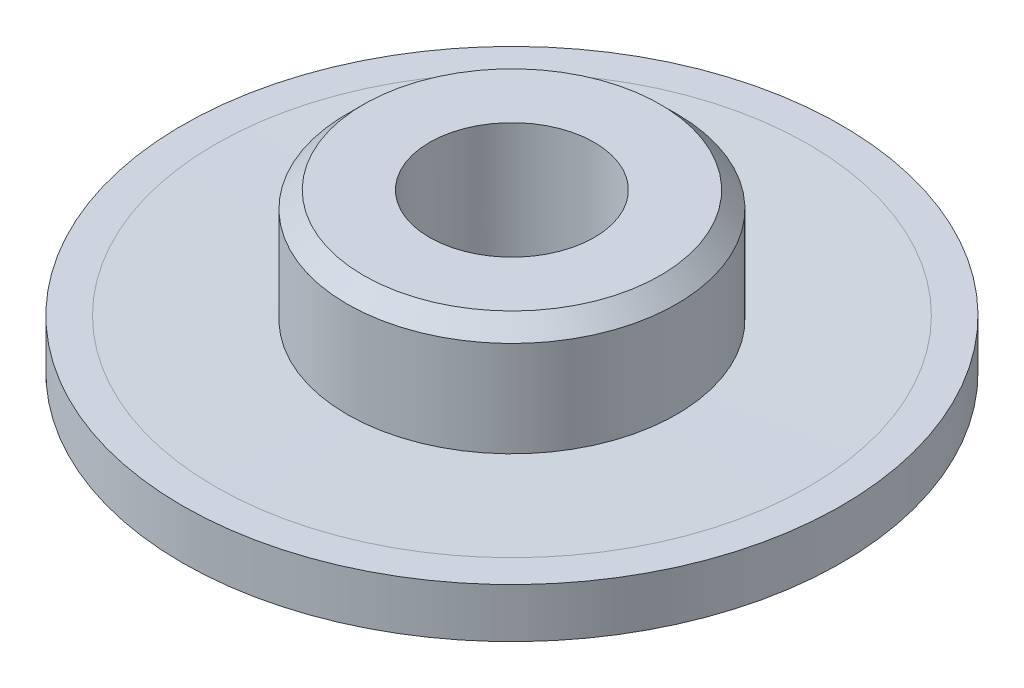
ISO-10303-21;
HEADER;
FILE_DESCRIPTION(('STEP AP214'),'2;1');
FILE_NAME('part.step','',(''),(''),'','','');
FILE_SCHEMA(('AUTOMOTIVE_DESIGN { 1 0 10303 214 1 1 1 1 }'));
ENDSEC;
DATA;
#1=APPLICATION_CONTEXT('core data for automotive mechanical design processes');
#2=APPLICATION_PROTOCOL_DEFINITION('international standard','automotive_design',2000,#1);
#3=PRODUCT_CONTEXT('',#1,'mechanical');
#4=PRODUCT('Part','Part','',(#3));
#5=PRODUCT_RELATED_PRODUCT_CATEGORY('part','',(#4));
#6=PRODUCT_DEFINITION_FORMATION('','',#4);
#7=PRODUCT_DEFINITION_CONTEXT('part definition',#1,'design');
#8=PRODUCT_DEFINITION('design','',#6,#7);
#9=PRODUCT_DEFINITION_SHAPE('','',#8);
#10=(LENGTH_UNIT() NAMED_UNIT(*) SI_UNIT(.MILLI.,.METRE.));
#11=(NAMED_UNIT(*) PLANE_ANGLE_UNIT() SI_UNIT($,.RADIAN.));
#12=(NAMED_UNIT(*) SI_UNIT($,.STERADIAN.) SOLID_ANGLE_UNIT());
#13=UNCERTAINTY_MEASURE_WITH_UNIT(LENGTH_MEASURE(1.E-05),#10,'distance_accuracy_value','');
#14=(GEOMETRIC_REPRESENTATION_CONTEXT(3) GLOBAL_UNCERTAINTY_ASSIGNED_CONTEXT((#13)) GLOBAL_UNIT_ASSIGNED_CONTEXT((#10,
#11,#12)) REPRESENTATION_CONTEXT('',''));
#15=CARTESIAN_POINT('',(0.,0.,0.));
#16=DIRECTION('',(0.,0.,1.));
#17=DIRECTION('',(1.,0.,0.));
#18=AXIS2_PLACEMENT_3D('',#15,#16,#17);
#19=CARTESIAN_POINT('',(0.,0.,0.));
#20=DIRECTION('',(0.,-1.,0.));
#21=DIRECTION('',(0.,0.,-1.));
#22=AXIS2_PLACEMENT_3D('',#19,#20,#21);
#23=CYLINDRICAL_SURFACE('',#22,2.5);
#24=CARTESIAN_POINT('',(0.,0.,0.));
#25=DIRECTION('',(0.,-1.,0.));
#26=DIRECTION('',(0.,0.,-1.));
#27=AXIS2_PLACEMENT_3D('',#24,#25,#26);
#28=CIRCLE('',#27,2.5);
#29=CARTESIAN_POINT('',(0.,0.,-2.5));
#30=VERTEX_POINT('',#29);
#31=EDGE_CURVE('E22',#30,#30,#28,.T.);
#32=ORIENTED_EDGE('',*,*,#31,.T.);
#33=EDGE_LOOP('',(#32));
#34=FACE_BOUND('',#33,.T.);
#35=CARTESIAN_POINT('',(0.,4.80000000000003,0.));
#36=DIRECTION('',(0.,1.,0.));
#37=DIRECTION('',(0.,0.,1.));
#38=AXIS2_PLACEMENT_3D('',#35,#36,#37);
#39=CIRCLE('',#38,2.5);
#40=CARTESIAN_POINT('',(0.,4.80000000000003,2.5));
#41=VERTEX_POINT('',#40);
#42=EDGE_CURVE('E10',#41,#41,#39,.T.);
#43=ORIENTED_EDGE('',*,*,#42,.T.);
#44=EDGE_LOOP('',(#43));
#45=FACE_BOUND('',#44,.T.);
#46=ADVANCED_FACE('F14',(#34,#45),#23,.F.);
#47=CARTESIAN_POINT('',(0.,-3.57627205087724,0.));
#48=DIRECTION('',(0.,1.,0.));
#49=DIRECTION('',(0.,0.,1.));
#50=AXIS2_PLACEMENT_3D('',#47,#48,#49);
#51=CYLINDRICAL_SURFACE('',#50,5.00000000024337);
#52=CARTESIAN_POINT('',(0.,4.3000000004757,0.));
#53=DIRECTION('',(0.,1.,0.));
#54=DIRECTION('',(0.,0.,1.));
#55=AXIS2_PLACEMENT_3D('',#52,#53,#54);
#56=CIRCLE('',#55,5.00000000024337);
#57=CARTESIAN_POINT('',(0.,4.3000000004757,5.00000000024334));
#58=VERTEX_POINT('',#57);
#59=EDGE_CURVE('E33',#58,#58,#56,.T.);
#60=ORIENTED_EDGE('',*,*,#59,.F.);
#61=EDGE_LOOP('',(#60));
#62=FACE_BOUND('',#61,.T.);
#63=CARTESIAN_POINT('',(0.,1.39999999343871,0.));
#64=DIRECTION('',(0.,1.,0.));
#65=DIRECTION('',(0.,0.,1.));
#66=AXIS2_PLACEMENT_3D('',#63,#64,#65);
#67=CIRCLE('',#66,5.00000000024337);
#68=CARTESIAN_POINT('',(0.,1.39999999343871,5.00000000024334));
#69=VERTEX_POINT('',#68);
#70=EDGE_CURVE('E27',#69,#69,#67,.T.);
#71=ORIENTED_EDGE('',*,*,#70,.T.);
#72=EDGE_LOOP('',(#71));
#73=FACE_BOUND('',#72,.T.);
#74=ADVANCED_FACE('F66',(#62,#73),#51,.T.);
#75=CARTESIAN_POINT('',(0.,1.39999999343871,0.));
#76=DIRECTION('',(0.,1.,0.));
#77=DIRECTION('',(0.,0.,1.));
#78=AXIS2_PLACEMENT_3D('',#75,#76,#77);
#79=CONICAL_SURFACE('',#78,5.00000000024337,1.54580153140963);
#80=CARTESIAN_POINT('',(0.,1.50000000050243,0.));
#81=DIRECTION('',(0.,1.,0.));
#82=DIRECTION('',(0.,0.,1.));
#83=AXIS2_PLACEMENT_3D('',#80,#81,#82);
#84=CIRCLE('',#83,9.);
#85=CARTESIAN_POINT('',(0.,1.50000000050243,8.99999999999998));
#86=VERTEX_POINT('',#85);
#87=EDGE_CURVE('E32',#86,#86,#84,.T.);
#88=ORIENTED_EDGE('',*,*,#87,.T.);
#89=EDGE_LOOP('',(#88));
#90=FACE_BOUND('',#89,.T.);
#91=ORIENTED_EDGE('',*,*,#70,.F.);
#92=EDGE_LOOP('',(#91));
#93=FACE_BOUND('',#92,.T.);
#94=ADVANCED_FACE('F62',(#90,#93),#79,.F.);
#95=CARTESIAN_POINT('',(0.,-3.57627205087724,0.));
#96=DIRECTION('',(0.,1.,0.));
#97=DIRECTION('',(0.,0.,1.));
#98=AXIS2_PLACEMENT_3D('',#95,#96,#97);
#99=CYLINDRICAL_SURFACE('',#98,10.0000000002426);
#100=CARTESIAN_POINT('',(0.,1.50000000050243,0.));
#101=DIRECTION('',(0.,1.,0.));
#102=DIRECTION('',(0.,0.,1.));
#103=AXIS2_PLACEMENT_3D('',#100,#101,#102);
#104=CIRCLE('',#103,10.0000000002426);
#105=CARTESIAN_POINT('',(0.,1.50000000050243,10.0000000002426));
#106=VERTEX_POINT('',#105);
#107=EDGE_CURVE('E40',#106,#106,#104,.T.);
#108=ORIENTED_EDGE('',*,*,#107,.F.);
#109=EDGE_LOOP('',(#108));
#110=FACE_BOUND('',#109,.T.);
#111=CARTESIAN_POINT('',(0.,0.,0.));
#112=DIRECTION('',(0.,1.,0.));
#113=DIRECTION('',(0.,0.,1.));
#114=AXIS2_PLACEMENT_3D('',#111,#112,#113);
#115=CIRCLE('',#114,10.0000000002426);
#116=CARTESIAN_POINT('',(0.,0.,10.0000000002426));
#117=VERTEX_POINT('',#116);
#118=EDGE_CURVE('E36',#117,#117,#115,.T.);
#119=ORIENTED_EDGE('',*,*,#118,.T.);
#120=EDGE_LOOP('',(#119));
#121=FACE_BOUND('',#120,.T.);
#122=ADVANCED_FACE('F51',(#110,#121),#99,.T.);
#123=CARTESIAN_POINT('',(0.,4.80000000000003,0.));
#124=DIRECTION('',(0.,-1.,0.));
#125=DIRECTION('',(0.,0.,-1.));
#126=AXIS2_PLACEMENT_3D('',#123,#124,#125);
#127=CONICAL_SURFACE('',#126,4.50000000071904,0.785398163397449);
#128=ORIENTED_EDGE('',*,*,#59,.T.);
#129=EDGE_LOOP('',(#128));
#130=FACE_BOUND('',#129,.T.);
#131=CARTESIAN_POINT('',(0.,4.80000000000003,0.));
#132=DIRECTION('',(0.,1.,0.));
#133=DIRECTION('',(0.,0.,1.));
#134=AXIS2_PLACEMENT_3D('',#131,#132,#133);
#135=CIRCLE('',#134,4.50000000071904);
#136=CARTESIAN_POINT('',(0.,4.80000000000003,4.50000000071901));
#137=VERTEX_POINT('',#136);
#138=EDGE_CURVE('E18',#137,#137,#135,.T.);
#139=ORIENTED_EDGE('',*,*,#138,.F.);
#140=EDGE_LOOP('',(#139));
#141=FACE_BOUND('',#140,.T.);
#142=ADVANCED_FACE('F49',(#130,#141),#127,.T.);
#143=CARTESIAN_POINT('',(0.,4.80000000000003,0.));
#144=DIRECTION('',(0.,1.,0.));
#145=DIRECTION('',(0.,0.,1.));
#146=AXIS2_PLACEMENT_3D('',#143,#144,#145);
#147=PLANE('',#146);
#148=ORIENTED_EDGE('',*,*,#42,.F.);
#149=EDGE_LOOP('',(#148));
#150=FACE_BOUND('',#149,.T.);
#151=ORIENTED_EDGE('',*,*,#138,.T.);
#152=EDGE_LOOP('',(#151));
#153=FACE_BOUND('',#152,.T.);
#154=ADVANCED_FACE('F47',(#150,#153),#147,.T.);
#155=CARTESIAN_POINT('',(10.0000000002426,0.,0.));
#156=DIRECTION('',(0.,-1.,0.));
#157=DIRECTION('',(0.,0.,-1.));
#158=AXIS2_PLACEMENT_3D('',#155,#156,#157);
#159=PLANE('',#158);
#160=ORIENTED_EDGE('',*,*,#31,.F.);
#161=EDGE_LOOP('',(#160));
#162=FACE_BOUND('',#161,.T.);
#163=ORIENTED_EDGE('',*,*,#118,.F.);
#164=EDGE_LOOP('',(#163));
#165=FACE_BOUND('',#164,.T.);
#166=ADVANCED_FACE('F59',(#162,#165),#159,.T.);
#167=CARTESIAN_POINT('',(9.,1.50000000050243,0.));
#168=DIRECTION('',(0.,1.,0.));
#169=DIRECTION('',(0.,0.,1.));
#170=AXIS2_PLACEMENT_3D('',#167,#168,#169);
#171=PLANE('',#170);
#172=ORIENTED_EDGE('',*,*,#107,.T.);
#173=EDGE_LOOP('',(#172));
#174=FACE_BOUND('',#173,.T.);
#175=ORIENTED_EDGE('',*,*,#87,.F.);
#176=EDGE_LOOP('',(#175));
#177=FACE_BOUND('',#176,.T.);
#178=ADVANCED_FACE('F16',(#174,#177),#171,.T.);
#179=CLOSED_SHELL('',(#46,#74,#94,#122,#142,#154,#166,#178));
#180=MANIFOLD_SOLID_BREP('B1',#179);
#181=ADVANCED_BREP_SHAPE_REPRESENTATION('',(#18,#180),#14);
#182=SHAPE_DEFINITION_REPRESENTATION(#9,#181);
ENDSEC;
END-ISO-10303-21;
